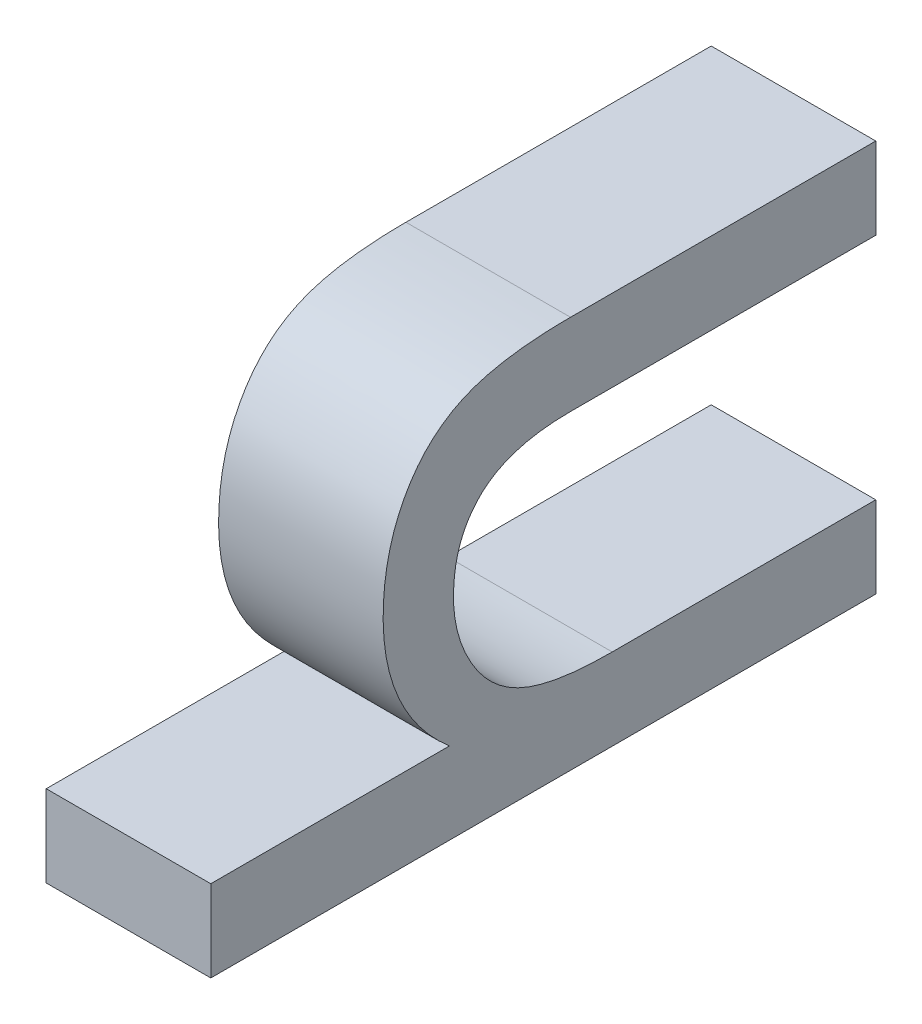
ISO-10303-21;
HEADER;
FILE_DESCRIPTION(('STEP AP214'),'2;1');
FILE_NAME('part.step','',(''),(''),'','','');
FILE_SCHEMA(('AUTOMOTIVE_DESIGN { 1 0 10303 214 1 1 1 1 }'));
ENDSEC;
DATA;
#1=APPLICATION_CONTEXT('core data for automotive mechanical design processes');
#2=APPLICATION_PROTOCOL_DEFINITION('international standard','automotive_design',2000,#1);
#3=PRODUCT_CONTEXT('',#1,'mechanical');
#4=PRODUCT('Part','Part','',(#3));
#5=PRODUCT_RELATED_PRODUCT_CATEGORY('part','',(#4));
#6=PRODUCT_DEFINITION_FORMATION('','',#4);
#7=PRODUCT_DEFINITION_CONTEXT('part definition',#1,'design');
#8=PRODUCT_DEFINITION('design','',#6,#7);
#9=PRODUCT_DEFINITION_SHAPE('','',#8);
#10=(LENGTH_UNIT() NAMED_UNIT(*) SI_UNIT(.MILLI.,.METRE.));
#11=(NAMED_UNIT(*) PLANE_ANGLE_UNIT() SI_UNIT($,.RADIAN.));
#12=(NAMED_UNIT(*) SI_UNIT($,.STERADIAN.) SOLID_ANGLE_UNIT());
#13=UNCERTAINTY_MEASURE_WITH_UNIT(LENGTH_MEASURE(1.E-05),#10,'distance_accuracy_value','');
#14=(GEOMETRIC_REPRESENTATION_CONTEXT(3) GLOBAL_UNCERTAINTY_ASSIGNED_CONTEXT((#13)) GLOBAL_UNIT_ASSIGNED_CONTEXT((#10,
#11,#12)) REPRESENTATION_CONTEXT('',''));
#15=CARTESIAN_POINT('',(0.,0.,0.));
#16=DIRECTION('',(0.,0.,1.));
#17=DIRECTION('',(1.,0.,0.));
#18=AXIS2_PLACEMENT_3D('',#15,#16,#17);
#19=CARTESIAN_POINT('',(4.5522994071292,-39.8047103887996,-8.75754347469336));
#20=DIRECTION('',(-1.,0.,0.));
#21=DIRECTION('',(0.,0.,1.));
#22=AXIS2_PLACEMENT_3D('',#19,#20,#21);
#23=PLANE('',#22);
#24=CARTESIAN_POINT('',(4.55229940712917,-39.5860826612727,-9.02665025987623));
#25=CARTESIAN_POINT('',(4.55229940712917,-39.5860826612727,-8.98943702965888));
#26=CARTESIAN_POINT('',(4.55229940712917,-39.6022083943669,-8.9724843358932));
#27=CARTESIAN_POINT('',(4.55229940712917,-39.618334127461,-8.95553164212752));
#28=CARTESIAN_POINT('',(4.55229940712918,-39.6478290580778,-8.95553164212752));
#29=CARTESIAN_POINT('',(4.55229940712918,-39.669881342651,-8.95553164212752));
#30=CARTESIAN_POINT('',(4.55229940712918,-39.6893149184312,-8.96697126474989));
#31=CARTESIAN_POINT('',(4.55229940712919,-39.7087484942113,-8.97841088737226));
#32=CARTESIAN_POINT('',(4.55229940712919,-39.7170181009263,-8.99798228993101));
#33=CARTESIAN_POINT('',(4.55229940712919,-39.7252877076413,-9.01755369248976));
#34=CARTESIAN_POINT('',(4.55229940712919,-39.7252877076413,-9.05201038713546));
#35=(BOUNDED_CURVE() B_SPLINE_CURVE(2,(#24,#25,#26,#27,#28,#29,#30,#31,#32,#33,#34),
.UNSPECIFIED.,.F.,.F.) B_SPLINE_CURVE_WITH_KNOTS((3,2,2,2,2,3),(23.9982958418541,
24.9982958418541,25.9982958418541,26.9982958418541,27.9982958418541,28.9982958418541),
.UNSPECIFIED.) CURVE() GEOMETRIC_REPRESENTATION_ITEM() RATIONAL_B_SPLINE_CURVE((1.,1.,1.,1.,1.,
1.,1.,1.,1.,1.,1.)) REPRESENTATION_ITEM(''));
#36=CARTESIAN_POINT('',(4.55229940712917,-39.5860826612727,-9.02665025987623));
#37=VERTEX_POINT('',#36);
#38=CARTESIAN_POINT('',(4.55229940712919,-39.7252877076413,-9.05201038713546));
#39=VERTEX_POINT('',#38);
#40=EDGE_CURVE('E279',#37,#39,#35,.T.);
#41=ORIENTED_EDGE('',*,*,#40,.T.);
#42=CARTESIAN_POINT('',(4.55229940712919,-39.7252877076413,-9.05201038713546));
#43=CARTESIAN_POINT('',(4.55229940712919,-39.7252877076413,-9.13208774549205));
#44=CARTESIAN_POINT('',(4.55229940712919,-39.7252877076413,-9.21216510384864));
#45=(BOUNDED_CURVE() B_SPLINE_CURVE(2,(#42,#43,#44),.UNSPECIFIED.,.F.,
.F.) B_SPLINE_CURVE_WITH_KNOTS((3,3),(28.9982958418541,29.988411724608),
.UNSPECIFIED.) CURVE() GEOMETRIC_REPRESENTATION_ITEM() RATIONAL_B_SPLINE_CURVE((1.,1.,1.)) REPRESENTATION_ITEM(''));
#46=CARTESIAN_POINT('',(4.55229940712919,-39.7252877076413,-9.21216510384864));
#47=VERTEX_POINT('',#46);
#48=EDGE_CURVE('E207',#39,#47,#45,.T.);
#49=ORIENTED_EDGE('',*,*,#48,.T.);
#50=CARTESIAN_POINT('',(4.55229940712919,-39.7252877076413,-9.21216510384864));
#51=CARTESIAN_POINT('',(4.55229940712919,-39.7500965277862,-9.21216510384864));
#52=CARTESIAN_POINT('',(4.5522994071292,-39.7749053479311,-9.21216510384864));
#53=(BOUNDED_CURVE() B_SPLINE_CURVE(2,(#50,#51,#52),.UNSPECIFIED.,.F.,
.F.) B_SPLINE_CURVE_WITH_KNOTS((3,3),(29.988411724608,30.2951601908657),
.UNSPECIFIED.) CURVE() GEOMETRIC_REPRESENTATION_ITEM() RATIONAL_B_SPLINE_CURVE((1.,1.,1.)) REPRESENTATION_ITEM(''));
#54=CARTESIAN_POINT('',(4.5522994071292,-39.7749053479311,-9.21216510384864));
#55=VERTEX_POINT('',#54);
#56=EDGE_CURVE('E91',#47,#55,#53,.T.);
#57=ORIENTED_EDGE('',*,*,#56,.T.);
#58=CARTESIAN_POINT('',(4.5522994071292,-39.7749053479311,-9.21216510384864));
#59=CARTESIAN_POINT('',(4.55229940712919,-39.7749053479311,-9.0101110464463));
#60=CARTESIAN_POINT('',(4.55229940712919,-39.7749053479311,-8.80805698904396));
#61=(BOUNDED_CURVE() B_SPLINE_CURVE(2,(#58,#59,#60),.UNSPECIFIED.,.F.,
.F.) B_SPLINE_CURVE_WITH_KNOTS((3,3),(30.2951601908657,32.7934560327198),
.UNSPECIFIED.) CURVE() GEOMETRIC_REPRESENTATION_ITEM() RATIONAL_B_SPLINE_CURVE((1.,1.,1.)) REPRESENTATION_ITEM(''));
#62=CARTESIAN_POINT('',(4.55229940712919,-39.7749053479311,-8.80805698904396));
#63=VERTEX_POINT('',#62);
#64=EDGE_CURVE('E179',#55,#63,#61,.T.);
#65=ORIENTED_EDGE('',*,*,#64,.T.);
#66=CARTESIAN_POINT('',(4.55229940712919,-39.7749053479311,-8.80805698904396));
#67=CARTESIAN_POINT('',(4.55229940712919,-39.7500965277862,-8.80805698904396));
#68=CARTESIAN_POINT('',(4.55229940712919,-39.7252877076413,-8.80805698904396));
#69=(BOUNDED_CURVE() B_SPLINE_CURVE(2,(#66,#67,#68),.UNSPECIFIED.,.F.,
.F.) B_SPLINE_CURVE_WITH_KNOTS((3,3),(32.7934560327198,33.1002044989775),
.UNSPECIFIED.) CURVE() GEOMETRIC_REPRESENTATION_ITEM() RATIONAL_B_SPLINE_CURVE((1.,1.,1.)) REPRESENTATION_ITEM(''));
#70=CARTESIAN_POINT('',(4.55229940712919,-39.7252877076413,-8.80805698904396));
#71=VERTEX_POINT('',#70);
#72=EDGE_CURVE('E258',#63,#71,#69,.T.);
#73=ORIENTED_EDGE('',*,*,#72,.T.);
#74=CARTESIAN_POINT('',(4.55229940712919,-39.7252877076413,-8.80805698904396));
#75=CARTESIAN_POINT('',(4.55229940712919,-39.7252877076413,-8.88055387457849));
#76=CARTESIAN_POINT('',(4.55229940712919,-39.7252877076413,-8.95305076011303));
#77=(BOUNDED_CURVE() B_SPLINE_CURVE(2,(#74,#75,#76),.UNSPECIFIED.,.F.,
.F.) B_SPLINE_CURVE_WITH_KNOTS((3,3),(33.1002044989775,33.9965916837082),
.UNSPECIFIED.) CURVE() GEOMETRIC_REPRESENTATION_ITEM() RATIONAL_B_SPLINE_CURVE((1.,1.,1.)) REPRESENTATION_ITEM(''));
#78=CARTESIAN_POINT('',(4.55229940712919,-39.7252877076413,-8.95305076011303));
#79=VERTEX_POINT('',#78);
#80=EDGE_CURVE('E149',#71,#79,#77,.T.);
#81=ORIENTED_EDGE('',*,*,#80,.T.);
#82=CARTESIAN_POINT('',(4.55229940712919,-39.7252877076413,-8.95305076011303));
#83=CARTESIAN_POINT('',(4.55229940712918,-39.6905553594384,-8.91280534076686));
#84=CARTESIAN_POINT('',(4.55229940712917,-39.6376298764626,-8.91280534076686));
#85=CARTESIAN_POINT('',(4.55229940712917,-39.6051027567171,-8.91280534076686));
#86=CARTESIAN_POINT('',(4.55229940712917,-39.5811208972437,-8.92562323117506));
#87=CARTESIAN_POINT('',(4.55229940712916,-39.5571390377703,-8.93844112158325));
#88=CARTESIAN_POINT('',(4.55229940712916,-39.5468020293766,-8.96104471327083));
#89=CARTESIAN_POINT('',(4.55229940712916,-39.5364650209829,-8.98364830495841));
#90=CARTESIAN_POINT('',(4.55229940712916,-39.5364650209829,-9.02665025987623));
#91=(BOUNDED_CURVE() B_SPLINE_CURVE(2,(#82,#83,#84,#85,#86,#87,#88,#89,#90),.UNSPECIFIED.,.F.,
.F.) B_SPLINE_CURVE_WITH_KNOTS((3,2,2,2,3),(33.9965916837082,34.9965916837082,35.9965916837082,
36.9965916837082,37.9965916837082),
.UNSPECIFIED.) CURVE() GEOMETRIC_REPRESENTATION_ITEM() RATIONAL_B_SPLINE_CURVE((1.,1.,1.,1.,1.,
1.,1.,1.,1.)) REPRESENTATION_ITEM(''));
#92=CARTESIAN_POINT('',(4.55229940712916,-39.5364650209829,-9.02665025987623));
#93=VERTEX_POINT('',#92);
#94=EDGE_CURVE('E146',#79,#93,#91,.T.);
#95=ORIENTED_EDGE('',*,*,#94,.T.);
#96=CARTESIAN_POINT('',(4.55229940712916,-39.5364650209829,-9.02665025987623));
#97=CARTESIAN_POINT('',(4.55229940712916,-39.5364650209829,-9.11940768186244));
#98=CARTESIAN_POINT('',(4.55229940712916,-39.5364650209829,-9.21216510384864));
#99=(BOUNDED_CURVE() B_SPLINE_CURVE(2,(#96,#97,#98),.UNSPECIFIED.,.F.,
.F.) B_SPLINE_CURVE_WITH_KNOTS((3,3),(37.9965916837082,38.9965916837082),
.UNSPECIFIED.) CURVE() GEOMETRIC_REPRESENTATION_ITEM() RATIONAL_B_SPLINE_CURVE((1.,1.,1.)) REPRESENTATION_ITEM(''));
#100=CARTESIAN_POINT('',(4.55229940712916,-39.5364650209829,-9.21216510384864));
#101=VERTEX_POINT('',#100);
#102=EDGE_CURVE('E134',#93,#101,#99,.T.);
#103=ORIENTED_EDGE('',*,*,#102,.T.);
#104=CARTESIAN_POINT('',(4.55229940712916,-39.5364650209829,-9.21216510384864));
#105=CARTESIAN_POINT('',(4.55229940712917,-39.5612738411278,-9.21216510384864));
#106=CARTESIAN_POINT('',(4.55229940712917,-39.5860826612727,-9.21216510384864));
#107=(BOUNDED_CURVE() B_SPLINE_CURVE(2,(#104,#105,#106),.UNSPECIFIED.,.F.,
.F.) B_SPLINE_CURVE_WITH_KNOTS((3,3),(38.9965916837082,39.9965916837082),
.UNSPECIFIED.) CURVE() GEOMETRIC_REPRESENTATION_ITEM() RATIONAL_B_SPLINE_CURVE((1.,1.,1.)) REPRESENTATION_ITEM(''));
#108=CARTESIAN_POINT('',(4.55229940712917,-39.5860826612727,-9.21216510384864));
#109=VERTEX_POINT('',#108);
#110=EDGE_CURVE('E295',#101,#109,#107,.T.);
#111=ORIENTED_EDGE('',*,*,#110,.T.);
#112=CARTESIAN_POINT('',(4.55229940712917,-39.5860826612727,-9.21216510384864));
#113=CARTESIAN_POINT('',(4.55229940712917,-39.5860826612727,-9.11940768186244));
#114=CARTESIAN_POINT('',(4.55229940712917,-39.5860826612727,-9.02665025987623));
#115=(BOUNDED_CURVE() B_SPLINE_CURVE(2,(#112,#113,#114),.UNSPECIFIED.,.F.,
.F.) B_SPLINE_CURVE_WITH_KNOTS((3,3),(39.9965916837082,40.9965916837082),
.UNSPECIFIED.) CURVE() GEOMETRIC_REPRESENTATION_ITEM() RATIONAL_B_SPLINE_CURVE((1.,1.,1.)) REPRESENTATION_ITEM(''));
#116=EDGE_CURVE('E11',#109,#37,#115,.T.);
#117=ORIENTED_EDGE('',*,*,#116,.T.);
#118=EDGE_LOOP('',(#41,#49,#57,#65,#73,#81,#95,#103,#111,#117));
#119=FACE_BOUND('',#118,.T.);
#120=ADVANCED_FACE('F16',(#119),#23,.T.);
#121=CARTESIAN_POINT('',(4.6522994071292,-39.8047103887996,-8.75754347469337));
#122=DIRECTION('',(1.,0.,0.));
#123=DIRECTION('',(0.,1.,0.));
#124=AXIS2_PLACEMENT_3D('',#121,#122,#123);
#125=PLANE('',#124);
#126=CARTESIAN_POINT('',(4.65229940712917,-39.5860826612727,-9.21216510384864));
#127=CARTESIAN_POINT('',(4.65229940712917,-39.5860826612727,-9.11940768186244));
#128=CARTESIAN_POINT('',(4.65229940712917,-39.5860826612727,-9.02665025987623));
#129=(BOUNDED_CURVE() B_SPLINE_CURVE(2,(#126,#127,#128),.UNSPECIFIED.,.F.,
.F.) B_SPLINE_CURVE_WITH_KNOTS((3,3),(39.9965916837082,40.9965916837082),
.UNSPECIFIED.) CURVE() GEOMETRIC_REPRESENTATION_ITEM() RATIONAL_B_SPLINE_CURVE((1.,1.,1.)) REPRESENTATION_ITEM(''));
#130=CARTESIAN_POINT('',(4.65229940712917,-39.5860826612727,-9.21216510384864));
#131=VERTEX_POINT('',#130);
#132=CARTESIAN_POINT('',(4.65229940712917,-39.5860826612727,-9.02665025987623));
#133=VERTEX_POINT('',#132);
#134=EDGE_CURVE('E28',#131,#133,#129,.T.);
#135=ORIENTED_EDGE('',*,*,#134,.F.);
#136=CARTESIAN_POINT('',(4.65229940712917,-39.5364650209829,-9.21216510384864));
#137=CARTESIAN_POINT('',(4.65229940712917,-39.5612738411278,-9.21216510384864));
#138=CARTESIAN_POINT('',(4.65229940712917,-39.5860826612727,-9.21216510384864));
#139=(BOUNDED_CURVE() B_SPLINE_CURVE(2,(#136,#137,#138),.UNSPECIFIED.,.F.,
.F.) B_SPLINE_CURVE_WITH_KNOTS((3,3),(38.9965916837082,39.9965916837082),
.UNSPECIFIED.) CURVE() GEOMETRIC_REPRESENTATION_ITEM() RATIONAL_B_SPLINE_CURVE((1.,1.,1.)) REPRESENTATION_ITEM(''));
#140=CARTESIAN_POINT('',(4.65229940712917,-39.5364650209829,-9.21216510384864));
#141=VERTEX_POINT('',#140);
#142=EDGE_CURVE('E125',#141,#131,#139,.T.);
#143=ORIENTED_EDGE('',*,*,#142,.F.);
#144=CARTESIAN_POINT('',(4.65229940712916,-39.5364650209829,-9.02665025987623));
#145=CARTESIAN_POINT('',(4.65229940712916,-39.5364650209829,-9.11940768186244));
#146=CARTESIAN_POINT('',(4.65229940712917,-39.5364650209829,-9.21216510384864));
#147=(BOUNDED_CURVE() B_SPLINE_CURVE(2,(#144,#145,#146),.UNSPECIFIED.,.F.,
.F.) B_SPLINE_CURVE_WITH_KNOTS((3,3),(37.9965916837082,38.9965916837082),
.UNSPECIFIED.) CURVE() GEOMETRIC_REPRESENTATION_ITEM() RATIONAL_B_SPLINE_CURVE((1.,1.,1.)) REPRESENTATION_ITEM(''));
#148=CARTESIAN_POINT('',(4.65229940712916,-39.5364650209829,-9.02665025987623));
#149=VERTEX_POINT('',#148);
#150=EDGE_CURVE('E154',#149,#141,#147,.T.);
#151=ORIENTED_EDGE('',*,*,#150,.F.);
#152=CARTESIAN_POINT('',(4.65229940712919,-39.7252877076413,-8.95305076011303));
#153=CARTESIAN_POINT('',(4.65229940712918,-39.6905553594384,-8.91280534076687));
#154=CARTESIAN_POINT('',(4.65229940712918,-39.6376298764626,-8.91280534076687));
#155=CARTESIAN_POINT('',(4.65229940712917,-39.6051027567171,-8.91280534076686));
#156=CARTESIAN_POINT('',(4.65229940712917,-39.5811208972437,-8.92562323117506));
#157=CARTESIAN_POINT('',(4.65229940712916,-39.5571390377703,-8.93844112158325));
#158=CARTESIAN_POINT('',(4.65229940712916,-39.5468020293766,-8.96104471327083));
#159=CARTESIAN_POINT('',(4.65229940712916,-39.5364650209829,-8.98364830495841));
#160=CARTESIAN_POINT('',(4.65229940712916,-39.5364650209829,-9.02665025987623));
#161=(BOUNDED_CURVE() B_SPLINE_CURVE(2,(#152,#153,#154,#155,#156,#157,#158,#159,#160),
.UNSPECIFIED.,.F.,.F.) B_SPLINE_CURVE_WITH_KNOTS((3,2,2,2,3),(33.9965916837082,34.9965916837082,
35.9965916837082,36.9965916837082,37.9965916837082),
.UNSPECIFIED.) CURVE() GEOMETRIC_REPRESENTATION_ITEM() RATIONAL_B_SPLINE_CURVE((1.,1.,1.,1.,1.,
1.,1.,1.,1.)) REPRESENTATION_ITEM(''));
#162=CARTESIAN_POINT('',(4.65229940712919,-39.7252877076413,-8.95305076011303));
#163=VERTEX_POINT('',#162);
#164=EDGE_CURVE('E157',#163,#149,#161,.T.);
#165=ORIENTED_EDGE('',*,*,#164,.F.);
#166=CARTESIAN_POINT('',(4.65229940712919,-39.7252877076413,-8.80805698904396));
#167=CARTESIAN_POINT('',(4.65229940712919,-39.7252877076413,-8.8805538745785));
#168=CARTESIAN_POINT('',(4.65229940712919,-39.7252877076413,-8.95305076011303));
#169=(BOUNDED_CURVE() B_SPLINE_CURVE(2,(#166,#167,#168),.UNSPECIFIED.,.F.,
.F.) B_SPLINE_CURVE_WITH_KNOTS((3,3),(33.1002044989775,33.9965916837082),
.UNSPECIFIED.) CURVE() GEOMETRIC_REPRESENTATION_ITEM() RATIONAL_B_SPLINE_CURVE((1.,1.,1.)) REPRESENTATION_ITEM(''));
#170=CARTESIAN_POINT('',(4.65229940712919,-39.7252877076413,-8.80805698904396));
#171=VERTEX_POINT('',#170);
#172=EDGE_CURVE('E248',#171,#163,#169,.T.);
#173=ORIENTED_EDGE('',*,*,#172,.F.);
#174=CARTESIAN_POINT('',(4.65229940712919,-39.7749053479311,-8.80805698904396));
#175=CARTESIAN_POINT('',(4.65229940712919,-39.7500965277861,-8.80805698904396));
#176=CARTESIAN_POINT('',(4.65229940712919,-39.7252877076413,-8.80805698904396));
#177=(BOUNDED_CURVE() B_SPLINE_CURVE(2,(#174,#175,#176),.UNSPECIFIED.,.F.,
.F.) B_SPLINE_CURVE_WITH_KNOTS((3,3),(32.7934560327198,33.1002044989775),
.UNSPECIFIED.) CURVE() GEOMETRIC_REPRESENTATION_ITEM() RATIONAL_B_SPLINE_CURVE((1.,1.,1.)) REPRESENTATION_ITEM(''));
#178=CARTESIAN_POINT('',(4.65229940712919,-39.7749053479311,-8.80805698904396));
#179=VERTEX_POINT('',#178);
#180=EDGE_CURVE('E188',#179,#171,#177,.T.);
#181=ORIENTED_EDGE('',*,*,#180,.F.);
#182=CARTESIAN_POINT('',(4.6522994071292,-39.7749053479311,-9.21216510384864));
#183=CARTESIAN_POINT('',(4.6522994071292,-39.7749053479311,-9.0101110464463));
#184=CARTESIAN_POINT('',(4.65229940712919,-39.7749053479311,-8.80805698904396));
#185=(BOUNDED_CURVE() B_SPLINE_CURVE(2,(#182,#183,#184),.UNSPECIFIED.,.F.,
.F.) B_SPLINE_CURVE_WITH_KNOTS((3,3),(30.2951601908657,32.7934560327198),
.UNSPECIFIED.) CURVE() GEOMETRIC_REPRESENTATION_ITEM() RATIONAL_B_SPLINE_CURVE((1.,1.,1.)) REPRESENTATION_ITEM(''));
#186=CARTESIAN_POINT('',(4.6522994071292,-39.7749053479311,-9.21216510384864));
#187=VERTEX_POINT('',#186);
#188=EDGE_CURVE('E74',#187,#179,#185,.T.);
#189=ORIENTED_EDGE('',*,*,#188,.F.);
#190=CARTESIAN_POINT('',(4.65229940712919,-39.7252877076413,-9.21216510384864));
#191=CARTESIAN_POINT('',(4.6522994071292,-39.7500965277861,-9.21216510384864));
#192=CARTESIAN_POINT('',(4.6522994071292,-39.7749053479311,-9.21216510384864));
#193=(BOUNDED_CURVE() B_SPLINE_CURVE(2,(#190,#191,#192),.UNSPECIFIED.,.F.,
.F.) B_SPLINE_CURVE_WITH_KNOTS((3,3),(29.988411724608,30.2951601908657),
.UNSPECIFIED.) CURVE() GEOMETRIC_REPRESENTATION_ITEM() RATIONAL_B_SPLINE_CURVE((1.,1.,1.)) REPRESENTATION_ITEM(''));
#194=CARTESIAN_POINT('',(4.65229940712919,-39.7252877076413,-9.21216510384864));
#195=VERTEX_POINT('',#194);
#196=EDGE_CURVE('E226',#195,#187,#193,.T.);
#197=ORIENTED_EDGE('',*,*,#196,.F.);
#198=CARTESIAN_POINT('',(4.65229940712919,-39.7252877076413,-9.05201038713546));
#199=CARTESIAN_POINT('',(4.65229940712919,-39.7252877076413,-9.13208774549205));
#200=CARTESIAN_POINT('',(4.65229940712919,-39.7252877076413,-9.21216510384864));
#201=(BOUNDED_CURVE() B_SPLINE_CURVE(2,(#198,#199,#200),.UNSPECIFIED.,.F.,
.F.) B_SPLINE_CURVE_WITH_KNOTS((3,3),(28.9982958418541,29.988411724608),
.UNSPECIFIED.) CURVE() GEOMETRIC_REPRESENTATION_ITEM() RATIONAL_B_SPLINE_CURVE((1.,1.,1.)) REPRESENTATION_ITEM(''));
#202=CARTESIAN_POINT('',(4.65229940712919,-39.7252877076413,-9.05201038713546));
#203=VERTEX_POINT('',#202);
#204=EDGE_CURVE('E208',#203,#195,#201,.T.);
#205=ORIENTED_EDGE('',*,*,#204,.F.);
#206=CARTESIAN_POINT('',(4.65229940712917,-39.5860826612727,-9.02665025987623));
#207=CARTESIAN_POINT('',(4.65229940712917,-39.5860826612727,-8.98943702965888));
#208=CARTESIAN_POINT('',(4.65229940712917,-39.6022083943669,-8.9724843358932));
#209=CARTESIAN_POINT('',(4.65229940712917,-39.618334127461,-8.95553164212752));
#210=CARTESIAN_POINT('',(4.65229940712918,-39.6478290580778,-8.95553164212752));
#211=CARTESIAN_POINT('',(4.65229940712918,-39.669881342651,-8.95553164212752));
#212=CARTESIAN_POINT('',(4.65229940712918,-39.6893149184311,-8.96697126474989));
#213=CARTESIAN_POINT('',(4.65229940712919,-39.7087484942113,-8.97841088737226));
#214=CARTESIAN_POINT('',(4.65229940712919,-39.7170181009263,-8.99798228993102));
#215=CARTESIAN_POINT('',(4.65229940712919,-39.7252877076413,-9.01755369248977));
#216=CARTESIAN_POINT('',(4.65229940712919,-39.7252877076413,-9.05201038713546));
#217=(BOUNDED_CURVE() B_SPLINE_CURVE(2,(#206,#207,#208,#209,#210,#211,#212,#213,#214,#215,#216),
.UNSPECIFIED.,.F.,.F.) B_SPLINE_CURVE_WITH_KNOTS((3,2,2,2,2,3),(23.9982958418541,
24.9982958418541,25.9982958418541,26.9982958418541,27.9982958418541,28.9982958418541),
.UNSPECIFIED.) CURVE() GEOMETRIC_REPRESENTATION_ITEM() RATIONAL_B_SPLINE_CURVE((1.,1.,1.,1.,1.,
1.,1.,1.,1.,1.,1.)) REPRESENTATION_ITEM(''));
#218=EDGE_CURVE('E227',#133,#203,#217,.T.);
#219=ORIENTED_EDGE('',*,*,#218,.F.);
#220=EDGE_LOOP('',(#135,#143,#151,#165,#173,#181,#189,#197,#205,#219));
#221=FACE_BOUND('',#220,.T.);
#222=ADVANCED_FACE('F335',(#221),#125,.T.);
#223=CARTESIAN_POINT('',(4.65229940712917,-39.5860826612727,-9.21216510384864));
#224=CARTESIAN_POINT('',(4.55229940712917,-39.5860826612727,-9.21216510384864));
#225=CARTESIAN_POINT('',(4.65229940712917,-39.5860826612727,-9.11940768186244));
#226=CARTESIAN_POINT('',(4.55229940712917,-39.5860826612727,-9.11940768186244));
#227=CARTESIAN_POINT('',(4.65229940712917,-39.5860826612727,-9.02665025987623));
#228=CARTESIAN_POINT('',(4.55229940712917,-39.5860826612727,-9.02665025987623));
#229=(BOUNDED_SURFACE() B_SPLINE_SURFACE(2,1,((#223,#224),(#225,#226),(#227,#228)),
.UNSPECIFIED.,.F.,.F.,.F.) B_SPLINE_SURFACE_WITH_KNOTS((3,3),(2,2),(39.9965916837082,
40.9965916837082),(0.,0.1),
.UNSPECIFIED.) GEOMETRIC_REPRESENTATION_ITEM() RATIONAL_B_SPLINE_SURFACE(((1.,1.),(1.,1.),(1.,1.))) REPRESENTATION_ITEM('') SURFACE());
#230=CARTESIAN_POINT('',(4.65229940712917,-39.5860826612727,-9.02665025987623));
#231=CARTESIAN_POINT('',(4.55229940712917,-39.5860826612727,-9.02665025987623));
#232=(BOUNDED_CURVE() B_SPLINE_CURVE(1,(#230,#231),.UNSPECIFIED.,.F.,
.F.) B_SPLINE_CURVE_WITH_KNOTS((2,2),(0.,0.1),
.UNSPECIFIED.) CURVE() GEOMETRIC_REPRESENTATION_ITEM() RATIONAL_B_SPLINE_CURVE((1.,1.)) REPRESENTATION_ITEM(''));
#233=EDGE_CURVE('E217',#133,#37,#232,.T.);
#234=CARTESIAN_POINT('',(4.65229940712917,-39.5860826612727,-9.21216510384864));
#235=CARTESIAN_POINT('',(4.55229940712917,-39.5860826612727,-9.21216510384864));
#236=(BOUNDED_CURVE() B_SPLINE_CURVE(1,(#234,#235),.UNSPECIFIED.,.F.,
.F.) B_SPLINE_CURVE_WITH_KNOTS((2,2),(0.,0.1),
.UNSPECIFIED.) CURVE() GEOMETRIC_REPRESENTATION_ITEM() RATIONAL_B_SPLINE_CURVE((1.,1.)) REPRESENTATION_ITEM(''));
#237=EDGE_CURVE('E265',#131,#109,#236,.T.);
#238=ORIENTED_EDGE('',*,*,#134,.T.);
#239=ORIENTED_EDGE('',*,*,#233,.T.);
#240=ORIENTED_EDGE('',*,*,#116,.F.);
#241=ORIENTED_EDGE('',*,*,#237,.F.);
#242=EDGE_LOOP('',(#238,#239,#240,#241));
#243=FACE_BOUND('',#242,.T.);
#244=ADVANCED_FACE('F394',(#243),#229,.T.);
#245=CARTESIAN_POINT('',(4.65229940712917,-39.5364650209829,-9.21216510384864));
#246=CARTESIAN_POINT('',(4.55229940712916,-39.5364650209829,-9.21216510384864));
#247=CARTESIAN_POINT('',(4.65229940712917,-39.5612738411278,-9.21216510384864));
#248=CARTESIAN_POINT('',(4.55229940712917,-39.5612738411278,-9.21216510384864));
#249=CARTESIAN_POINT('',(4.65229940712917,-39.5860826612727,-9.21216510384864));
#250=CARTESIAN_POINT('',(4.55229940712917,-39.5860826612727,-9.21216510384864));
#251=(BOUNDED_SURFACE() B_SPLINE_SURFACE(2,1,((#245,#246),(#247,#248),(#249,#250)),
.UNSPECIFIED.,.F.,.F.,.F.) B_SPLINE_SURFACE_WITH_KNOTS((3,3),(2,2),(38.9965916837082,
39.9965916837082),(0.,0.1),
.UNSPECIFIED.) GEOMETRIC_REPRESENTATION_ITEM() RATIONAL_B_SPLINE_SURFACE(((1.,1.),(1.,1.),(1.,1.))) REPRESENTATION_ITEM('') SURFACE());
#252=CARTESIAN_POINT('',(4.65229940712917,-39.5364650209829,-9.21216510384864));
#253=CARTESIAN_POINT('',(4.55229940712916,-39.5364650209829,-9.21216510384864));
#254=(BOUNDED_CURVE() B_SPLINE_CURVE(1,(#252,#253),.UNSPECIFIED.,.F.,
.F.) B_SPLINE_CURVE_WITH_KNOTS((2,2),(0.,0.1),
.UNSPECIFIED.) CURVE() GEOMETRIC_REPRESENTATION_ITEM() RATIONAL_B_SPLINE_CURVE((1.,1.)) REPRESENTATION_ITEM(''));
#255=EDGE_CURVE('E141',#141,#101,#254,.T.);
#256=ORIENTED_EDGE('',*,*,#142,.T.);
#257=ORIENTED_EDGE('',*,*,#237,.T.);
#258=ORIENTED_EDGE('',*,*,#110,.F.);
#259=ORIENTED_EDGE('',*,*,#255,.F.);
#260=EDGE_LOOP('',(#256,#257,#258,#259));
#261=FACE_BOUND('',#260,.T.);
#262=ADVANCED_FACE('F397',(#261),#251,.T.);
#263=CARTESIAN_POINT('',(4.65229940712916,-39.5364650209829,-9.02665025987623));
#264=CARTESIAN_POINT('',(4.55229940712916,-39.5364650209829,-9.02665025987623));
#265=CARTESIAN_POINT('',(4.65229940712916,-39.5364650209829,-9.11940768186244));
#266=CARTESIAN_POINT('',(4.55229940712916,-39.5364650209829,-9.11940768186244));
#267=CARTESIAN_POINT('',(4.65229940712917,-39.5364650209829,-9.21216510384864));
#268=CARTESIAN_POINT('',(4.55229940712916,-39.5364650209829,-9.21216510384864));
#269=(BOUNDED_SURFACE() B_SPLINE_SURFACE(2,1,((#263,#264),(#265,#266),(#267,#268)),
.UNSPECIFIED.,.F.,.F.,.F.) B_SPLINE_SURFACE_WITH_KNOTS((3,3),(2,2),(37.9965916837082,
38.9965916837082),(0.,0.1),
.UNSPECIFIED.) GEOMETRIC_REPRESENTATION_ITEM() RATIONAL_B_SPLINE_SURFACE(((1.,1.),(1.,1.),(1.,1.))) REPRESENTATION_ITEM('') SURFACE());
#270=CARTESIAN_POINT('',(4.65229940712916,-39.5364650209829,-9.02665025987623));
#271=CARTESIAN_POINT('',(4.55229940712916,-39.5364650209829,-9.02665025987623));
#272=(BOUNDED_CURVE() B_SPLINE_CURVE(1,(#270,#271),.UNSPECIFIED.,.F.,
.F.) B_SPLINE_CURVE_WITH_KNOTS((2,2),(0.,0.1),
.UNSPECIFIED.) CURVE() GEOMETRIC_REPRESENTATION_ITEM() RATIONAL_B_SPLINE_CURVE((1.,1.)) REPRESENTATION_ITEM(''));
#273=EDGE_CURVE('E139',#149,#93,#272,.T.);
#274=ORIENTED_EDGE('',*,*,#150,.T.);
#275=ORIENTED_EDGE('',*,*,#255,.T.);
#276=ORIENTED_EDGE('',*,*,#102,.F.);
#277=ORIENTED_EDGE('',*,*,#273,.F.);
#278=EDGE_LOOP('',(#274,#275,#276,#277));
#279=FACE_BOUND('',#278,.T.);
#280=ADVANCED_FACE('F137',(#279),#269,.T.);
#281=CARTESIAN_POINT('',(4.65229940712919,-39.7252877076413,-8.95305076011303));
#282=CARTESIAN_POINT('',(4.55229940712919,-39.7252877076413,-8.95305076011303));
#283=CARTESIAN_POINT('',(4.65229940712918,-39.6905553594384,-8.91280534076687));
#284=CARTESIAN_POINT('',(4.55229940712918,-39.6905553594384,-8.91280534076686));
#285=CARTESIAN_POINT('',(4.65229940712918,-39.6376298764626,-8.91280534076687));
#286=CARTESIAN_POINT('',(4.55229940712917,-39.6376298764626,-8.91280534076686));
#287=CARTESIAN_POINT('',(4.65229940712917,-39.6051027567171,-8.91280534076686));
#288=CARTESIAN_POINT('',(4.55229940712917,-39.6051027567171,-8.91280534076686));
#289=CARTESIAN_POINT('',(4.65229940712917,-39.5811208972437,-8.92562323117506));
#290=CARTESIAN_POINT('',(4.55229940712917,-39.5811208972437,-8.92562323117506));
#291=CARTESIAN_POINT('',(4.65229940712916,-39.5571390377703,-8.93844112158325));
#292=CARTESIAN_POINT('',(4.55229940712916,-39.5571390377703,-8.93844112158325));
#293=CARTESIAN_POINT('',(4.65229940712916,-39.5468020293766,-8.96104471327083));
#294=CARTESIAN_POINT('',(4.55229940712916,-39.5468020293766,-8.96104471327083));
#295=CARTESIAN_POINT('',(4.65229940712916,-39.5364650209829,-8.98364830495841));
#296=CARTESIAN_POINT('',(4.55229940712916,-39.5364650209829,-8.98364830495841));
#297=CARTESIAN_POINT('',(4.65229940712916,-39.5364650209829,-9.02665025987623));
#298=CARTESIAN_POINT('',(4.55229940712916,-39.5364650209829,-9.02665025987623));
#299=(BOUNDED_SURFACE() B_SPLINE_SURFACE(2,1,((#281,#282),(#283,#284),(#285,#286),(#287,#288),
(#289,#290),(#291,#292),(#293,#294),(#295,#296),(#297,#298)),.UNSPECIFIED.,.F.,.F.,
.F.) B_SPLINE_SURFACE_WITH_KNOTS((3,2,2,2,3),(2,2),(33.9965916837082,34.9965916837082,
35.9965916837082,36.9965916837082,37.9965916837082),(0.,0.1),
.UNSPECIFIED.) GEOMETRIC_REPRESENTATION_ITEM() RATIONAL_B_SPLINE_SURFACE(((1.,1.),(1.,1.),(1.,
1.),(1.,1.),(1.,1.),(1.,1.),(1.,1.),(1.,1.),(1.,1.))) REPRESENTATION_ITEM('') SURFACE());
#300=CARTESIAN_POINT('',(4.65229940712919,-39.7252877076413,-8.95305076011303));
#301=CARTESIAN_POINT('',(4.55229940712919,-39.7252877076413,-8.95305076011303));
#302=(BOUNDED_CURVE() B_SPLINE_CURVE(1,(#300,#301),.UNSPECIFIED.,.F.,
.F.) B_SPLINE_CURVE_WITH_KNOTS((2,2),(0.,0.1),
.UNSPECIFIED.) CURVE() GEOMETRIC_REPRESENTATION_ITEM() RATIONAL_B_SPLINE_CURVE((1.,1.)) REPRESENTATION_ITEM(''));
#303=EDGE_CURVE('E257',#163,#79,#302,.T.);
#304=ORIENTED_EDGE('',*,*,#164,.T.);
#305=ORIENTED_EDGE('',*,*,#273,.T.);
#306=ORIENTED_EDGE('',*,*,#94,.F.);
#307=ORIENTED_EDGE('',*,*,#303,.F.);
#308=EDGE_LOOP('',(#304,#305,#306,#307));
#309=FACE_BOUND('',#308,.T.);
#310=ADVANCED_FACE('F156',(#309),#299,.T.);
#311=CARTESIAN_POINT('',(4.65229940712919,-39.7252877076413,-8.80805698904396));
#312=CARTESIAN_POINT('',(4.55229940712919,-39.7252877076413,-8.80805698904396));
#313=CARTESIAN_POINT('',(4.65229940712919,-39.7252877076413,-8.8805538745785));
#314=CARTESIAN_POINT('',(4.55229940712919,-39.7252877076413,-8.88055387457849));
#315=CARTESIAN_POINT('',(4.65229940712919,-39.7252877076413,-8.95305076011303));
#316=CARTESIAN_POINT('',(4.55229940712919,-39.7252877076413,-8.95305076011303));
#317=(BOUNDED_SURFACE() B_SPLINE_SURFACE(2,1,((#311,#312),(#313,#314),(#315,#316)),
.UNSPECIFIED.,.F.,.F.,.F.) B_SPLINE_SURFACE_WITH_KNOTS((3,3),(2,2),(33.1002044989775,
33.9965916837082),(0.,0.1),
.UNSPECIFIED.) GEOMETRIC_REPRESENTATION_ITEM() RATIONAL_B_SPLINE_SURFACE(((1.,1.),(1.,1.),(1.,1.))) REPRESENTATION_ITEM('') SURFACE());
#318=CARTESIAN_POINT('',(4.65229940712919,-39.7252877076413,-8.80805698904396));
#319=CARTESIAN_POINT('',(4.55229940712919,-39.7252877076413,-8.80805698904396));
#320=(BOUNDED_CURVE() B_SPLINE_CURVE(1,(#318,#319),.UNSPECIFIED.,.F.,
.F.) B_SPLINE_CURVE_WITH_KNOTS((2,2),(0.,0.1),
.UNSPECIFIED.) CURVE() GEOMETRIC_REPRESENTATION_ITEM() RATIONAL_B_SPLINE_CURVE((1.,1.)) REPRESENTATION_ITEM(''));
#321=EDGE_CURVE('E169',#171,#71,#320,.T.);
#322=ORIENTED_EDGE('',*,*,#172,.T.);
#323=ORIENTED_EDGE('',*,*,#303,.T.);
#324=ORIENTED_EDGE('',*,*,#80,.F.);
#325=ORIENTED_EDGE('',*,*,#321,.F.);
#326=EDGE_LOOP('',(#322,#323,#324,#325));
#327=FACE_BOUND('',#326,.T.);
#328=ADVANCED_FACE('F339',(#327),#317,.T.);
#329=CARTESIAN_POINT('',(4.65229940712919,-39.7749053479311,-8.80805698904396));
#330=CARTESIAN_POINT('',(4.55229940712919,-39.7749053479311,-8.80805698904396));
#331=CARTESIAN_POINT('',(4.65229940712919,-39.7500965277861,-8.80805698904396));
#332=CARTESIAN_POINT('',(4.55229940712919,-39.7500965277862,-8.80805698904396));
#333=CARTESIAN_POINT('',(4.65229940712919,-39.7252877076413,-8.80805698904396));
#334=CARTESIAN_POINT('',(4.55229940712919,-39.7252877076413,-8.80805698904396));
#335=(BOUNDED_SURFACE() B_SPLINE_SURFACE(2,1,((#329,#330),(#331,#332),(#333,#334)),
.UNSPECIFIED.,.F.,.F.,.F.) B_SPLINE_SURFACE_WITH_KNOTS((3,3),(2,2),(32.7934560327198,
33.1002044989775),(0.,0.1),
.UNSPECIFIED.) GEOMETRIC_REPRESENTATION_ITEM() RATIONAL_B_SPLINE_SURFACE(((1.,1.),(1.,1.),(1.,1.))) REPRESENTATION_ITEM('') SURFACE());
#336=CARTESIAN_POINT('',(4.65229940712919,-39.7749053479311,-8.80805698904396));
#337=CARTESIAN_POINT('',(4.55229940712919,-39.7749053479311,-8.80805698904396));
#338=(BOUNDED_CURVE() B_SPLINE_CURVE(1,(#336,#337),.UNSPECIFIED.,.F.,
.F.) B_SPLINE_CURVE_WITH_KNOTS((2,2),(0.,0.1),
.UNSPECIFIED.) CURVE() GEOMETRIC_REPRESENTATION_ITEM() RATIONAL_B_SPLINE_CURVE((1.,1.)) REPRESENTATION_ITEM(''));
#339=EDGE_CURVE('E189',#179,#63,#338,.T.);
#340=ORIENTED_EDGE('',*,*,#180,.T.);
#341=ORIENTED_EDGE('',*,*,#321,.T.);
#342=ORIENTED_EDGE('',*,*,#72,.F.);
#343=ORIENTED_EDGE('',*,*,#339,.F.);
#344=EDGE_LOOP('',(#340,#341,#342,#343));
#345=FACE_BOUND('',#344,.T.);
#346=ADVANCED_FACE('F343',(#345),#335,.T.);
#347=CARTESIAN_POINT('',(4.6522994071292,-39.7749053479311,-9.21216510384864));
#348=CARTESIAN_POINT('',(4.5522994071292,-39.7749053479311,-9.21216510384864));
#349=CARTESIAN_POINT('',(4.6522994071292,-39.7749053479311,-9.0101110464463));
#350=CARTESIAN_POINT('',(4.55229940712919,-39.7749053479311,-9.0101110464463));
#351=CARTESIAN_POINT('',(4.65229940712919,-39.7749053479311,-8.80805698904396));
#352=CARTESIAN_POINT('',(4.55229940712919,-39.7749053479311,-8.80805698904396));
#353=(BOUNDED_SURFACE() B_SPLINE_SURFACE(2,1,((#347,#348),(#349,#350),(#351,#352)),
.UNSPECIFIED.,.F.,.F.,.F.) B_SPLINE_SURFACE_WITH_KNOTS((3,3),(2,2),(30.2951601908657,
32.7934560327198),(0.,0.1),
.UNSPECIFIED.) GEOMETRIC_REPRESENTATION_ITEM() RATIONAL_B_SPLINE_SURFACE(((1.,1.),(1.,1.),(1.,1.))) REPRESENTATION_ITEM('') SURFACE());
#354=CARTESIAN_POINT('',(4.6522994071292,-39.7749053479311,-9.21216510384864));
#355=CARTESIAN_POINT('',(4.5522994071292,-39.7749053479311,-9.21216510384864));
#356=(BOUNDED_CURVE() B_SPLINE_CURVE(1,(#354,#355),.UNSPECIFIED.,.F.,
.F.) B_SPLINE_CURVE_WITH_KNOTS((2,2),(0.,0.1),
.UNSPECIFIED.) CURVE() GEOMETRIC_REPRESENTATION_ITEM() RATIONAL_B_SPLINE_CURVE((1.,1.)) REPRESENTATION_ITEM(''));
#357=EDGE_CURVE('E218',#187,#55,#356,.T.);
#358=ORIENTED_EDGE('',*,*,#188,.T.);
#359=ORIENTED_EDGE('',*,*,#339,.T.);
#360=ORIENTED_EDGE('',*,*,#64,.F.);
#361=ORIENTED_EDGE('',*,*,#357,.F.);
#362=EDGE_LOOP('',(#358,#359,#360,#361));
#363=FACE_BOUND('',#362,.T.);
#364=ADVANCED_FACE('F345',(#363),#353,.T.);
#365=CARTESIAN_POINT('',(4.65229940712919,-39.7252877076413,-9.21216510384864));
#366=CARTESIAN_POINT('',(4.55229940712919,-39.7252877076413,-9.21216510384864));
#367=CARTESIAN_POINT('',(4.6522994071292,-39.7500965277861,-9.21216510384864));
#368=CARTESIAN_POINT('',(4.55229940712919,-39.7500965277862,-9.21216510384864));
#369=CARTESIAN_POINT('',(4.6522994071292,-39.7749053479311,-9.21216510384864));
#370=CARTESIAN_POINT('',(4.5522994071292,-39.7749053479311,-9.21216510384864));
#371=(BOUNDED_SURFACE() B_SPLINE_SURFACE(2,1,((#365,#366),(#367,#368),(#369,#370)),
.UNSPECIFIED.,.F.,.F.,.F.) B_SPLINE_SURFACE_WITH_KNOTS((3,3),(2,2),(29.988411724608,
30.2951601908657),(0.,0.1),
.UNSPECIFIED.) GEOMETRIC_REPRESENTATION_ITEM() RATIONAL_B_SPLINE_SURFACE(((1.,1.),(1.,1.),(1.,1.))) REPRESENTATION_ITEM('') SURFACE());
#372=CARTESIAN_POINT('',(4.65229940712919,-39.7252877076413,-9.21216510384864));
#373=CARTESIAN_POINT('',(4.55229940712919,-39.7252877076413,-9.21216510384864));
#374=(BOUNDED_CURVE() B_SPLINE_CURVE(1,(#372,#373),.UNSPECIFIED.,.F.,
.F.) B_SPLINE_CURVE_WITH_KNOTS((2,2),(0.,0.1),
.UNSPECIFIED.) CURVE() GEOMETRIC_REPRESENTATION_ITEM() RATIONAL_B_SPLINE_CURVE((1.,1.)) REPRESENTATION_ITEM(''));
#375=EDGE_CURVE('E198',#195,#47,#374,.T.);
#376=ORIENTED_EDGE('',*,*,#196,.T.);
#377=ORIENTED_EDGE('',*,*,#357,.T.);
#378=ORIENTED_EDGE('',*,*,#56,.F.);
#379=ORIENTED_EDGE('',*,*,#375,.F.);
#380=EDGE_LOOP('',(#376,#377,#378,#379));
#381=FACE_BOUND('',#380,.T.);
#382=ADVANCED_FACE('F347',(#381),#371,.T.);
#383=CARTESIAN_POINT('',(4.65229940712919,-39.7252877076413,-9.05201038713546));
#384=CARTESIAN_POINT('',(4.55229940712919,-39.7252877076413,-9.05201038713546));
#385=CARTESIAN_POINT('',(4.65229940712919,-39.7252877076413,-9.13208774549205));
#386=CARTESIAN_POINT('',(4.55229940712919,-39.7252877076413,-9.13208774549205));
#387=CARTESIAN_POINT('',(4.65229940712919,-39.7252877076413,-9.21216510384864));
#388=CARTESIAN_POINT('',(4.55229940712919,-39.7252877076413,-9.21216510384864));
#389=(BOUNDED_SURFACE() B_SPLINE_SURFACE(2,1,((#383,#384),(#385,#386),(#387,#388)),
.UNSPECIFIED.,.F.,.F.,.F.) B_SPLINE_SURFACE_WITH_KNOTS((3,3),(2,2),(28.9982958418541,
29.988411724608),(0.,0.1),
.UNSPECIFIED.) GEOMETRIC_REPRESENTATION_ITEM() RATIONAL_B_SPLINE_SURFACE(((1.,1.),(1.,1.),(1.,1.))) REPRESENTATION_ITEM('') SURFACE());
#390=CARTESIAN_POINT('',(4.65229940712919,-39.7252877076413,-9.05201038713546));
#391=CARTESIAN_POINT('',(4.55229940712919,-39.7252877076413,-9.05201038713546));
#392=(BOUNDED_CURVE() B_SPLINE_CURVE(1,(#390,#391),.UNSPECIFIED.,.F.,
.F.) B_SPLINE_CURVE_WITH_KNOTS((2,2),(0.,0.1),
.UNSPECIFIED.) CURVE() GEOMETRIC_REPRESENTATION_ITEM() RATIONAL_B_SPLINE_CURVE((1.,1.)) REPRESENTATION_ITEM(''));
#393=EDGE_CURVE('E19',#203,#39,#392,.T.);
#394=ORIENTED_EDGE('',*,*,#204,.T.);
#395=ORIENTED_EDGE('',*,*,#375,.T.);
#396=ORIENTED_EDGE('',*,*,#48,.F.);
#397=ORIENTED_EDGE('',*,*,#393,.F.);
#398=EDGE_LOOP('',(#394,#395,#396,#397));
#399=FACE_BOUND('',#398,.T.);
#400=ADVANCED_FACE('F389',(#399),#389,.T.);
#401=CARTESIAN_POINT('',(4.65229940712917,-39.5860826612727,-9.02665025987623));
#402=CARTESIAN_POINT('',(4.55229940712917,-39.5860826612727,-9.02665025987623));
#403=CARTESIAN_POINT('',(4.65229940712917,-39.5860826612727,-8.98943702965888));
#404=CARTESIAN_POINT('',(4.55229940712917,-39.5860826612727,-8.98943702965888));
#405=CARTESIAN_POINT('',(4.65229940712917,-39.6022083943669,-8.9724843358932));
#406=CARTESIAN_POINT('',(4.55229940712917,-39.6022083943669,-8.9724843358932));
#407=CARTESIAN_POINT('',(4.65229940712917,-39.618334127461,-8.95553164212752));
#408=CARTESIAN_POINT('',(4.55229940712917,-39.618334127461,-8.95553164212752));
#409=CARTESIAN_POINT('',(4.65229940712918,-39.6478290580778,-8.95553164212752));
#410=CARTESIAN_POINT('',(4.55229940712918,-39.6478290580778,-8.95553164212752));
#411=CARTESIAN_POINT('',(4.65229940712918,-39.669881342651,-8.95553164212752));
#412=CARTESIAN_POINT('',(4.55229940712918,-39.669881342651,-8.95553164212752));
#413=CARTESIAN_POINT('',(4.65229940712918,-39.6893149184311,-8.96697126474989));
#414=CARTESIAN_POINT('',(4.55229940712918,-39.6893149184312,-8.96697126474989));
#415=CARTESIAN_POINT('',(4.65229940712919,-39.7087484942113,-8.97841088737226));
#416=CARTESIAN_POINT('',(4.55229940712919,-39.7087484942113,-8.97841088737226));
#417=CARTESIAN_POINT('',(4.65229940712919,-39.7170181009263,-8.99798228993102));
#418=CARTESIAN_POINT('',(4.55229940712919,-39.7170181009263,-8.99798228993101));
#419=CARTESIAN_POINT('',(4.65229940712919,-39.7252877076413,-9.01755369248977));
#420=CARTESIAN_POINT('',(4.55229940712919,-39.7252877076413,-9.01755369248976));
#421=CARTESIAN_POINT('',(4.65229940712919,-39.7252877076413,-9.05201038713546));
#422=CARTESIAN_POINT('',(4.55229940712919,-39.7252877076413,-9.05201038713546));
#423=(BOUNDED_SURFACE() B_SPLINE_SURFACE(2,1,((#401,#402),(#403,#404),(#405,#406),(#407,#408),
(#409,#410),(#411,#412),(#413,#414),(#415,#416),(#417,#418),(#419,#420),(#421,#422)),
.UNSPECIFIED.,.F.,.F.,.F.) B_SPLINE_SURFACE_WITH_KNOTS((3,2,2,2,2,3),(2,2),(23.9982958418541,
24.9982958418541,25.9982958418541,26.9982958418541,27.9982958418541,28.9982958418541),(0.,0.1),
.UNSPECIFIED.) GEOMETRIC_REPRESENTATION_ITEM() RATIONAL_B_SPLINE_SURFACE(((1.,1.),(1.,1.),(1.,
1.),(1.,1.),(1.,1.),(1.,1.),(1.,1.),(1.,1.),(1.,1.),(1.,1.),(1.,1.))) REPRESENTATION_ITEM('') SURFACE());
#424=ORIENTED_EDGE('',*,*,#218,.T.);
#425=ORIENTED_EDGE('',*,*,#393,.T.);
#426=ORIENTED_EDGE('',*,*,#40,.F.);
#427=ORIENTED_EDGE('',*,*,#233,.F.);
#428=EDGE_LOOP('',(#424,#425,#426,#427));
#429=FACE_BOUND('',#428,.T.);
#430=ADVANCED_FACE('F393',(#429),#423,.T.);
#431=CLOSED_SHELL('',(#120,#222,#244,#262,#280,#310,#328,#346,#364,#382,#400,#430));
#432=MANIFOLD_SOLID_BREP('B1',#431);
#433=ADVANCED_BREP_SHAPE_REPRESENTATION('',(#18,#432),#14);
#434=SHAPE_DEFINITION_REPRESENTATION(#9,#433);
ENDSEC;
END-ISO-10303-21;
